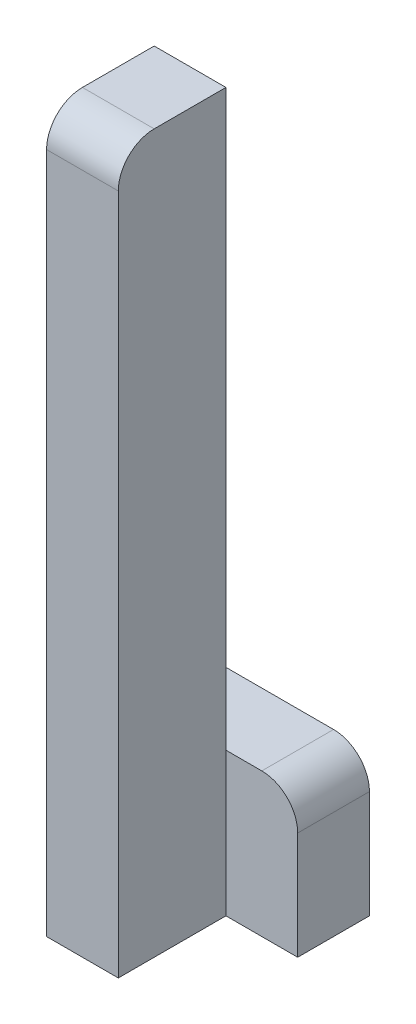
ISO-10303-21;
HEADER;
FILE_DESCRIPTION(('STEP AP214'),'2;1');
FILE_NAME('part.step','',(''),(''),'','','');
FILE_SCHEMA(('AUTOMOTIVE_DESIGN { 1 0 10303 214 1 1 1 1 }'));
ENDSEC;
DATA;
#1=APPLICATION_CONTEXT('core data for automotive mechanical design processes');
#2=APPLICATION_PROTOCOL_DEFINITION('international standard','automotive_design',2000,#1);
#3=PRODUCT_CONTEXT('',#1,'mechanical');
#4=PRODUCT('Part','Part','',(#3));
#5=PRODUCT_RELATED_PRODUCT_CATEGORY('part','',(#4));
#6=PRODUCT_DEFINITION_FORMATION('','',#4);
#7=PRODUCT_DEFINITION_CONTEXT('part definition',#1,'design');
#8=PRODUCT_DEFINITION('design','',#6,#7);
#9=PRODUCT_DEFINITION_SHAPE('','',#8);
#10=(LENGTH_UNIT() NAMED_UNIT(*) SI_UNIT(.MILLI.,.METRE.));
#11=(NAMED_UNIT(*) PLANE_ANGLE_UNIT() SI_UNIT($,.RADIAN.));
#12=(NAMED_UNIT(*) SI_UNIT($,.STERADIAN.) SOLID_ANGLE_UNIT());
#13=UNCERTAINTY_MEASURE_WITH_UNIT(LENGTH_MEASURE(1.E-05),#10,'distance_accuracy_value','');
#14=(GEOMETRIC_REPRESENTATION_CONTEXT(3) GLOBAL_UNCERTAINTY_ASSIGNED_CONTEXT((#13)) GLOBAL_UNIT_ASSIGNED_CONTEXT((#10,
#11,#12)) REPRESENTATION_CONTEXT('',''));
#15=CARTESIAN_POINT('',(0.,0.,0.));
#16=DIRECTION('',(0.,0.,1.));
#17=DIRECTION('',(1.,0.,0.));
#18=AXIS2_PLACEMENT_3D('',#15,#16,#17);
#19=CARTESIAN_POINT('',(-10.,0.,30.));
#20=DIRECTION('',(0.,-1.,0.));
#21=DIRECTION('',(1.,0.,0.));
#22=AXIS2_PLACEMENT_3D('',#19,#20,#21);
#23=PLANE('',#22);
#24=DIRECTION('',(0.,0.,-1.));
#25=VECTOR('',#24,1.);
#26=CARTESIAN_POINT('',(-30.,0.,30.));
#27=LINE('',#26,#25);
#28=CARTESIAN_POINT('',(-30.,0.,20.));
#29=VERTEX_POINT('',#28);
#30=CARTESIAN_POINT('',(-30.,0.,0.));
#31=VERTEX_POINT('',#30);
#32=EDGE_CURVE('E171',#29,#31,#27,.T.);
#33=ORIENTED_EDGE('',*,*,#32,.F.);
#34=DIRECTION('',(-1.,0.,0.));
#35=VECTOR('',#34,1.);
#36=CARTESIAN_POINT('',(-10.,0.,20.));
#37=LINE('',#36,#35);
#38=CARTESIAN_POINT('',(-10.,0.,20.));
#39=VERTEX_POINT('',#38);
#40=EDGE_CURVE('E43',#29,#39,#37,.F.);
#41=ORIENTED_EDGE('',*,*,#40,.T.);
#42=DIRECTION('',(0.,0.,-1.));
#43=VECTOR('',#42,1.);
#44=CARTESIAN_POINT('',(-10.,0.,30.));
#45=LINE('',#44,#43);
#46=CARTESIAN_POINT('',(-10.,0.,0.));
#47=VERTEX_POINT('',#46);
#48=EDGE_CURVE('E158',#39,#47,#45,.T.);
#49=ORIENTED_EDGE('',*,*,#48,.T.);
#50=DIRECTION('',(-1.,0.,0.));
#51=VECTOR('',#50,1.);
#52=CARTESIAN_POINT('',(-10.,0.,0.));
#53=LINE('',#52,#51);
#54=EDGE_CURVE('E148',#47,#31,#53,.T.);
#55=ORIENTED_EDGE('',*,*,#54,.T.);
#56=EDGE_LOOP('',(#33,#41,#49,#55));
#57=FACE_BOUND('',#56,.T.);
#58=ADVANCED_FACE('F35',(#57),#23,.F.);
#59=CARTESIAN_POINT('',(-30.,0.,30.));
#60=DIRECTION('',(1.,0.,0.));
#61=DIRECTION('',(0.,0.,-1.));
#62=AXIS2_PLACEMENT_3D('',#59,#60,#61);
#63=PLANE('',#62);
#64=DIRECTION('',(0.,-1.,0.));
#65=VECTOR('',#64,1.);
#66=CARTESIAN_POINT('',(-30.,0.,30.));
#67=LINE('',#66,#65);
#68=CARTESIAN_POINT('',(-30.,-10.,30.));
#69=VERTEX_POINT('',#68);
#70=CARTESIAN_POINT('',(-30.,-200.,30.));
#71=VERTEX_POINT('',#70);
#72=EDGE_CURVE('E150',#69,#71,#67,.T.);
#73=ORIENTED_EDGE('',*,*,#72,.F.);
#74=CARTESIAN_POINT('',(-30.,-10.,20.));
#75=DIRECTION('',(1.,0.,0.));
#76=DIRECTION('',(0.,0.,-1.));
#77=AXIS2_PLACEMENT_3D('',#74,#75,#76);
#78=CIRCLE('',#77,10.);
#79=EDGE_CURVE('E57',#69,#29,#78,.F.);
#80=ORIENTED_EDGE('',*,*,#79,.T.);
#81=ORIENTED_EDGE('',*,*,#32,.T.);
#82=DIRECTION('',(0.,-1.,0.));
#83=VECTOR('',#82,1.);
#84=CARTESIAN_POINT('',(-30.,0.,0.));
#85=LINE('',#84,#83);
#86=CARTESIAN_POINT('',(-30.,-160.,0.));
#87=VERTEX_POINT('',#86);
#88=EDGE_CURVE('E126',#31,#87,#85,.T.);
#89=ORIENTED_EDGE('',*,*,#88,.T.);
#90=DIRECTION('',(0.,0.,1.));
#91=VECTOR('',#90,1.);
#92=CARTESIAN_POINT('',(-30.,-160.,-20.));
#93=LINE('',#92,#91);
#94=CARTESIAN_POINT('',(-30.,-160.,-20.));
#95=VERTEX_POINT('',#94);
#96=EDGE_CURVE('E111',#95,#87,#93,.T.);
#97=ORIENTED_EDGE('',*,*,#96,.F.);
#98=DIRECTION('',(0.,-1.,0.));
#99=VECTOR('',#98,1.);
#100=CARTESIAN_POINT('',(-30.,-160.,-20.));
#101=LINE('',#100,#99);
#102=CARTESIAN_POINT('',(-30.,-200.,-20.));
#103=VERTEX_POINT('',#102);
#104=EDGE_CURVE('E118',#95,#103,#101,.T.);
#105=ORIENTED_EDGE('',*,*,#104,.T.);
#106=DIRECTION('',(0.,0.,-1.));
#107=VECTOR('',#106,1.);
#108=CARTESIAN_POINT('',(-30.,-200.,30.));
#109=LINE('',#108,#107);
#110=EDGE_CURVE('E169',#71,#103,#109,.T.);
#111=ORIENTED_EDGE('',*,*,#110,.F.);
#112=EDGE_LOOP('',(#73,#80,#81,#89,#97,#105,#111));
#113=FACE_BOUND('',#112,.T.);
#114=ADVANCED_FACE('F123',(#113),#63,.F.);
#115=CARTESIAN_POINT('',(-30.,-200.,30.));
#116=DIRECTION('',(0.,1.,0.));
#117=DIRECTION('',(0.,0.,1.));
#118=AXIS2_PLACEMENT_3D('',#115,#116,#117);
#119=PLANE('',#118);
#120=ORIENTED_EDGE('',*,*,#110,.T.);
#121=DIRECTION('',(1.,0.,0.));
#122=VECTOR('',#121,1.);
#123=CARTESIAN_POINT('',(-30.,-200.,-20.));
#124=LINE('',#123,#122);
#125=CARTESIAN_POINT('',(10.,-200.,-20.));
#126=VERTEX_POINT('',#125);
#127=EDGE_CURVE('E134',#103,#126,#124,.T.);
#128=ORIENTED_EDGE('',*,*,#127,.T.);
#129=DIRECTION('',(0.,0.,1.));
#130=VECTOR('',#129,1.);
#131=CARTESIAN_POINT('',(10.,-200.,-20.));
#132=LINE('',#131,#130);
#133=CARTESIAN_POINT('',(10.,-200.,0.));
#134=VERTEX_POINT('',#133);
#135=EDGE_CURVE('E127',#126,#134,#132,.T.);
#136=ORIENTED_EDGE('',*,*,#135,.T.);
#137=DIRECTION('',(1.,0.,0.));
#138=VECTOR('',#137,1.);
#139=CARTESIAN_POINT('',(-30.,-200.,0.));
#140=LINE('',#139,#138);
#141=CARTESIAN_POINT('',(-10.,-200.,0.));
#142=VERTEX_POINT('',#141);
#143=EDGE_CURVE('E142',#142,#134,#140,.T.);
#144=ORIENTED_EDGE('',*,*,#143,.F.);
#145=DIRECTION('',(0.,0.,-1.));
#146=VECTOR('',#145,1.);
#147=CARTESIAN_POINT('',(-10.,-200.,30.));
#148=LINE('',#147,#146);
#149=CARTESIAN_POINT('',(-10.,-200.,30.));
#150=VERTEX_POINT('',#149);
#151=EDGE_CURVE('E166',#150,#142,#148,.T.);
#152=ORIENTED_EDGE('',*,*,#151,.F.);
#153=DIRECTION('',(1.,0.,0.));
#154=VECTOR('',#153,1.);
#155=CARTESIAN_POINT('',(-30.,-200.,30.));
#156=LINE('',#155,#154);
#157=EDGE_CURVE('E152',#71,#150,#156,.T.);
#158=ORIENTED_EDGE('',*,*,#157,.F.);
#159=EDGE_LOOP('',(#120,#128,#136,#144,#152,#158));
#160=FACE_BOUND('',#159,.T.);
#161=ADVANCED_FACE('F193',(#160),#119,.F.);
#162=CARTESIAN_POINT('',(-10.,-200.,30.));
#163=DIRECTION('',(-1.,0.,0.));
#164=DIRECTION('',(0.,0.,1.));
#165=AXIS2_PLACEMENT_3D('',#162,#163,#164);
#166=PLANE('',#165);
#167=ORIENTED_EDGE('',*,*,#48,.F.);
#168=CARTESIAN_POINT('',(-10.,-10.,20.));
#169=DIRECTION('',(-1.,0.,0.));
#170=DIRECTION('',(0.,0.,1.));
#171=AXIS2_PLACEMENT_3D('',#168,#169,#170);
#172=CIRCLE('',#171,10.);
#173=CARTESIAN_POINT('',(-10.,-10.,30.));
#174=VERTEX_POINT('',#173);
#175=EDGE_CURVE('E11',#39,#174,#172,.F.);
#176=ORIENTED_EDGE('',*,*,#175,.T.);
#177=DIRECTION('',(0.,1.,0.));
#178=VECTOR('',#177,1.);
#179=CARTESIAN_POINT('',(-10.,-200.,30.));
#180=LINE('',#179,#178);
#181=EDGE_CURVE('E155',#150,#174,#180,.T.);
#182=ORIENTED_EDGE('',*,*,#181,.F.);
#183=ORIENTED_EDGE('',*,*,#151,.T.);
#184=DIRECTION('',(0.,1.,0.));
#185=VECTOR('',#184,1.);
#186=CARTESIAN_POINT('',(-10.,-200.,0.));
#187=LINE('',#186,#185);
#188=CARTESIAN_POINT('',(-10.,-160.,0.));
#189=VERTEX_POINT('',#188);
#190=EDGE_CURVE('E153',#142,#189,#187,.T.);
#191=ORIENTED_EDGE('',*,*,#190,.T.);
#192=EDGE_CURVE('E162',#189,#47,#187,.T.);
#193=ORIENTED_EDGE('',*,*,#192,.T.);
#194=EDGE_LOOP('',(#167,#176,#182,#183,#191,#193));
#195=FACE_BOUND('',#194,.T.);
#196=ADVANCED_FACE('F196',(#195),#166,.F.);
#197=CARTESIAN_POINT('',(0.,0.,30.));
#198=DIRECTION('',(0.,0.,1.));
#199=DIRECTION('',(1.,0.,0.));
#200=AXIS2_PLACEMENT_3D('',#197,#198,#199);
#201=PLANE('',#200);
#202=ORIENTED_EDGE('',*,*,#181,.T.);
#203=DIRECTION('',(-1.,0.,0.));
#204=VECTOR('',#203,1.);
#205=CARTESIAN_POINT('',(-30.,-10.,30.));
#206=LINE('',#205,#204);
#207=EDGE_CURVE('E181',#174,#69,#206,.T.);
#208=ORIENTED_EDGE('',*,*,#207,.T.);
#209=ORIENTED_EDGE('',*,*,#72,.T.);
#210=ORIENTED_EDGE('',*,*,#157,.T.);
#211=EDGE_LOOP('',(#202,#208,#209,#210));
#212=FACE_BOUND('',#211,.T.);
#213=ADVANCED_FACE('F186',(#212),#201,.T.);
#214=CARTESIAN_POINT('',(0.,0.,0.));
#215=DIRECTION('',(0.,0.,1.));
#216=DIRECTION('',(1.,0.,0.));
#217=AXIS2_PLACEMENT_3D('',#214,#215,#216);
#218=PLANE('',#217);
#219=ORIENTED_EDGE('',*,*,#192,.F.);
#220=DIRECTION('',(-1.,0.,0.));
#221=VECTOR('',#220,1.);
#222=CARTESIAN_POINT('',(10.,-160.,0.));
#223=LINE('',#222,#221);
#224=EDGE_CURVE('E143',#189,#87,#223,.T.);
#225=ORIENTED_EDGE('',*,*,#224,.T.);
#226=ORIENTED_EDGE('',*,*,#88,.F.);
#227=ORIENTED_EDGE('',*,*,#54,.F.);
#228=EDGE_LOOP('',(#219,#225,#226,#227));
#229=FACE_BOUND('',#228,.T.);
#230=ADVANCED_FACE('F215',(#229),#218,.F.);
#231=CARTESIAN_POINT('',(0.,0.,0.));
#232=DIRECTION('',(0.,0.,1.));
#233=DIRECTION('',(1.,0.,0.));
#234=AXIS2_PLACEMENT_3D('',#231,#232,#233);
#235=PLANE('',#234);
#236=DIRECTION('',(0.,1.,0.));
#237=VECTOR('',#236,1.);
#238=CARTESIAN_POINT('',(10.,-200.,0.));
#239=LINE('',#238,#237);
#240=CARTESIAN_POINT('',(10.,-170.,0.));
#241=VERTEX_POINT('',#240);
#242=EDGE_CURVE('E119',#134,#241,#239,.T.);
#243=ORIENTED_EDGE('',*,*,#242,.T.);
#244=CARTESIAN_POINT('',(0.,-170.,0.));
#245=DIRECTION('',(0.,0.,1.));
#246=DIRECTION('',(1.,0.,0.));
#247=AXIS2_PLACEMENT_3D('',#244,#245,#246);
#248=CIRCLE('',#247,10.);
#249=CARTESIAN_POINT('',(0.,-160.,0.));
#250=VERTEX_POINT('',#249);
#251=EDGE_CURVE('E176',#241,#250,#248,.T.);
#252=ORIENTED_EDGE('',*,*,#251,.T.);
#253=EDGE_CURVE('E140',#250,#189,#223,.T.);
#254=ORIENTED_EDGE('',*,*,#253,.T.);
#255=ORIENTED_EDGE('',*,*,#190,.F.);
#256=ORIENTED_EDGE('',*,*,#143,.T.);
#257=EDGE_LOOP('',(#243,#252,#254,#255,#256));
#258=FACE_BOUND('',#257,.T.);
#259=ADVANCED_FACE('F218',(#258),#235,.T.);
#260=CARTESIAN_POINT('',(10.,-160.,-20.));
#261=DIRECTION('',(0.,1.,0.));
#262=DIRECTION('',(0.,0.,1.));
#263=AXIS2_PLACEMENT_3D('',#260,#261,#262);
#264=PLANE('',#263);
#265=ORIENTED_EDGE('',*,*,#253,.F.);
#266=DIRECTION('',(0.,0.,1.));
#267=VECTOR('',#266,1.);
#268=CARTESIAN_POINT('',(0.,-160.,-20.));
#269=LINE('',#268,#267);
#270=CARTESIAN_POINT('',(0.,-160.,-20.));
#271=VERTEX_POINT('',#270);
#272=EDGE_CURVE('E114',#250,#271,#269,.F.);
#273=ORIENTED_EDGE('',*,*,#272,.T.);
#274=DIRECTION('',(-1.,0.,0.));
#275=VECTOR('',#274,1.);
#276=CARTESIAN_POINT('',(10.,-160.,-20.));
#277=LINE('',#276,#275);
#278=EDGE_CURVE('E106',#271,#95,#277,.T.);
#279=ORIENTED_EDGE('',*,*,#278,.T.);
#280=ORIENTED_EDGE('',*,*,#96,.T.);
#281=ORIENTED_EDGE('',*,*,#224,.F.);
#282=EDGE_LOOP('',(#265,#273,#279,#280,#281));
#283=FACE_BOUND('',#282,.T.);
#284=ADVANCED_FACE('F109',(#283),#264,.T.);
#285=CARTESIAN_POINT('',(10.,-200.,-20.));
#286=DIRECTION('',(1.,0.,0.));
#287=DIRECTION('',(0.,0.,-1.));
#288=AXIS2_PLACEMENT_3D('',#285,#286,#287);
#289=PLANE('',#288);
#290=DIRECTION('',(0.,1.,0.));
#291=VECTOR('',#290,1.);
#292=CARTESIAN_POINT('',(10.,-200.,-20.));
#293=LINE('',#292,#291);
#294=CARTESIAN_POINT('',(10.,-170.,-20.));
#295=VERTEX_POINT('',#294);
#296=EDGE_CURVE('E128',#126,#295,#293,.T.);
#297=ORIENTED_EDGE('',*,*,#296,.T.);
#298=DIRECTION('',(0.,0.,1.));
#299=VECTOR('',#298,1.);
#300=CARTESIAN_POINT('',(10.,-170.,-20.));
#301=LINE('',#300,#299);
#302=EDGE_CURVE('E173',#295,#241,#301,.T.);
#303=ORIENTED_EDGE('',*,*,#302,.T.);
#304=ORIENTED_EDGE('',*,*,#242,.F.);
#305=ORIENTED_EDGE('',*,*,#135,.F.);
#306=EDGE_LOOP('',(#297,#303,#304,#305));
#307=FACE_BOUND('',#306,.T.);
#308=ADVANCED_FACE('F224',(#307),#289,.T.);
#309=CARTESIAN_POINT('',(0.,0.,-20.));
#310=DIRECTION('',(0.,0.,1.));
#311=DIRECTION('',(1.,0.,0.));
#312=AXIS2_PLACEMENT_3D('',#309,#310,#311);
#313=PLANE('',#312);
#314=ORIENTED_EDGE('',*,*,#278,.F.);
#315=CARTESIAN_POINT('',(0.,-170.,-20.));
#316=DIRECTION('',(0.,0.,1.));
#317=DIRECTION('',(1.,0.,0.));
#318=AXIS2_PLACEMENT_3D('',#315,#316,#317);
#319=CIRCLE('',#318,10.);
#320=EDGE_CURVE('E179',#271,#295,#319,.F.);
#321=ORIENTED_EDGE('',*,*,#320,.T.);
#322=ORIENTED_EDGE('',*,*,#296,.F.);
#323=ORIENTED_EDGE('',*,*,#127,.F.);
#324=ORIENTED_EDGE('',*,*,#104,.F.);
#325=EDGE_LOOP('',(#314,#321,#322,#323,#324));
#326=FACE_BOUND('',#325,.T.);
#327=ADVANCED_FACE('F131',(#326),#313,.F.);
#328=CARTESIAN_POINT('',(0.,-170.,-20.));
#329=DIRECTION('',(0.,0.,1.));
#330=DIRECTION('',(1.,0.,0.));
#331=AXIS2_PLACEMENT_3D('',#328,#329,#330);
#332=CYLINDRICAL_SURFACE('',#331,10.);
#333=ORIENTED_EDGE('',*,*,#320,.F.);
#334=ORIENTED_EDGE('',*,*,#272,.F.);
#335=ORIENTED_EDGE('',*,*,#251,.F.);
#336=ORIENTED_EDGE('',*,*,#302,.F.);
#337=EDGE_LOOP('',(#333,#334,#335,#336));
#338=FACE_BOUND('',#337,.T.);
#339=ADVANCED_FACE('F199',(#338),#332,.T.);
#340=CARTESIAN_POINT('',(0.,-10.,20.));
#341=DIRECTION('',(1.,0.,0.));
#342=DIRECTION('',(0.,1.,0.));
#343=AXIS2_PLACEMENT_3D('',#340,#341,#342);
#344=CYLINDRICAL_SURFACE('',#343,10.);
#345=ORIENTED_EDGE('',*,*,#175,.F.);
#346=ORIENTED_EDGE('',*,*,#40,.F.);
#347=ORIENTED_EDGE('',*,*,#79,.F.);
#348=ORIENTED_EDGE('',*,*,#207,.F.);
#349=EDGE_LOOP('',(#345,#346,#347,#348));
#350=FACE_BOUND('',#349,.T.);
#351=ADVANCED_FACE('F37',(#350),#344,.T.);
#352=CLOSED_SHELL('',(#58,#114,#161,#196,#213,#230,#259,#284,#308,#327,#339,#351));
#353=MANIFOLD_SOLID_BREP('B2',#352);
#354=ADVANCED_BREP_SHAPE_REPRESENTATION('',(#18,#353),#14);
#355=SHAPE_DEFINITION_REPRESENTATION(#9,#354);
ENDSEC;
END-ISO-10303-21;
